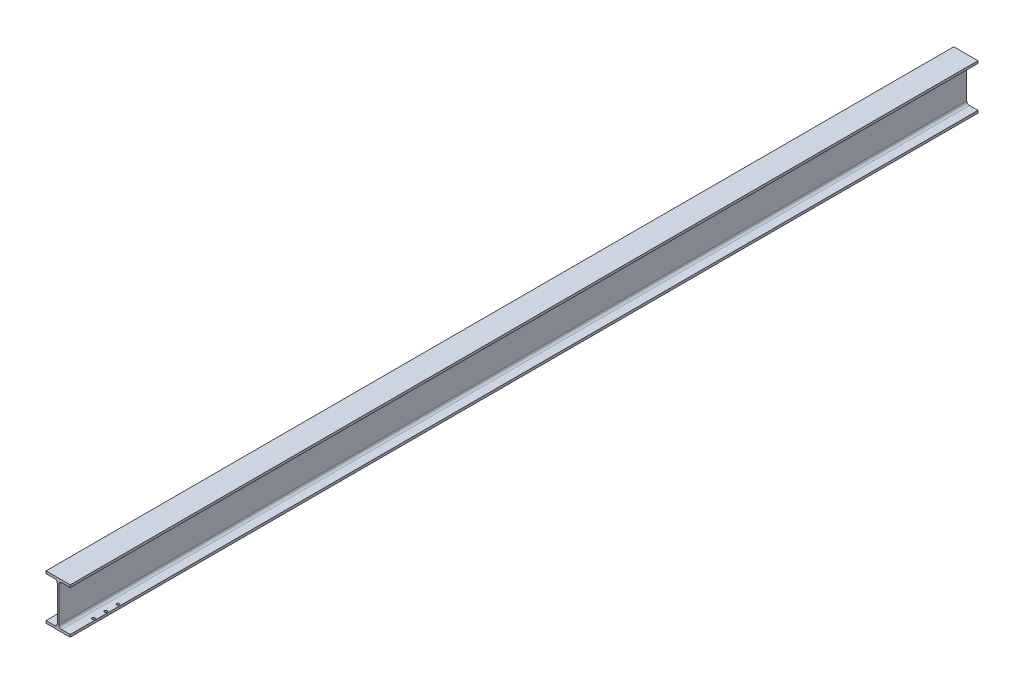
ISO-10303-21;
HEADER;
FILE_DESCRIPTION(('STEP AP214'),'2;1');
FILE_NAME('part.step','',(''),(''),'','','');
FILE_SCHEMA(('AUTOMOTIVE_DESIGN { 1 0 10303 214 1 1 1 1 }'));
ENDSEC;
DATA;
#1=APPLICATION_CONTEXT('core data for automotive mechanical design processes');
#2=APPLICATION_PROTOCOL_DEFINITION('international standard','automotive_design',2000,#1);
#3=PRODUCT_CONTEXT('',#1,'mechanical');
#4=PRODUCT('Part','Part','',(#3));
#5=PRODUCT_RELATED_PRODUCT_CATEGORY('part','',(#4));
#6=PRODUCT_DEFINITION_FORMATION('','',#4);
#7=PRODUCT_DEFINITION_CONTEXT('part definition',#1,'design');
#8=PRODUCT_DEFINITION('design','',#6,#7);
#9=PRODUCT_DEFINITION_SHAPE('','',#8);
#10=(LENGTH_UNIT() NAMED_UNIT(*) SI_UNIT(.MILLI.,.METRE.));
#11=(NAMED_UNIT(*) PLANE_ANGLE_UNIT() SI_UNIT($,.RADIAN.));
#12=(NAMED_UNIT(*) SI_UNIT($,.STERADIAN.) SOLID_ANGLE_UNIT());
#13=UNCERTAINTY_MEASURE_WITH_UNIT(LENGTH_MEASURE(1.E-05),#10,'distance_accuracy_value','');
#14=(GEOMETRIC_REPRESENTATION_CONTEXT(3) GLOBAL_UNCERTAINTY_ASSIGNED_CONTEXT((#13)) GLOBAL_UNIT_ASSIGNED_CONTEXT((#10,
#11,#12)) REPRESENTATION_CONTEXT('',''));
#15=CARTESIAN_POINT('',(0.,0.,0.));
#16=DIRECTION('',(0.,0.,1.));
#17=DIRECTION('',(1.,0.,0.));
#18=AXIS2_PLACEMENT_3D('',#15,#16,#17);
#19=CARTESIAN_POINT('',(0.,-60.,1200.));
#20=DIRECTION('',(0.,1.,0.));
#21=DIRECTION('',(-1.,0.,0.));
#22=AXIS2_PLACEMENT_3D('',#19,#20,#21);
#23=PLANE('',#22);
#24=CARTESIAN_POINT('',(25.9999999999999,-60.,1067.5));
#25=DIRECTION('',(0.,-1.,0.));
#26=DIRECTION('',(0.,0.,-1.));
#27=AXIS2_PLACEMENT_3D('',#24,#25,#26);
#28=CIRCLE('',#27,3.5);
#29=CARTESIAN_POINT('',(25.9999999999999,-60.,1064.));
#30=VERTEX_POINT('',#29);
#31=EDGE_CURVE('E563',#30,#30,#28,.T.);
#32=ORIENTED_EDGE('',*,*,#31,.F.);
#33=EDGE_LOOP('',(#32));
#34=FACE_BOUND('',#33,.T.);
#35=CARTESIAN_POINT('',(25.9999999999999,-60.,1100.));
#36=DIRECTION('',(0.,-1.,0.));
#37=DIRECTION('',(0.,0.,-1.));
#38=AXIS2_PLACEMENT_3D('',#35,#36,#37);
#39=CIRCLE('',#38,3.5);
#40=CARTESIAN_POINT('',(25.9999999999999,-60.,1096.5));
#41=VERTEX_POINT('',#40);
#42=EDGE_CURVE('E577',#41,#41,#39,.T.);
#43=ORIENTED_EDGE('',*,*,#42,.F.);
#44=EDGE_LOOP('',(#43));
#45=FACE_BOUND('',#44,.T.);
#46=DIRECTION('',(1.,0.,0.));
#47=VECTOR('',#46,1.);
#48=CARTESIAN_POINT('',(0.,-60.,-1200.));
#49=LINE('',#48,#47);
#50=CARTESIAN_POINT('',(-32.,-60.,-1200.));
#51=VERTEX_POINT('',#50);
#52=CARTESIAN_POINT('',(32.,-60.,-1200.));
#53=VERTEX_POINT('',#52);
#54=EDGE_CURVE('E165',#51,#53,#49,.T.);
#55=ORIENTED_EDGE('',*,*,#54,.T.);
#56=DIRECTION('',(0.,0.,-1.));
#57=VECTOR('',#56,1.);
#58=CARTESIAN_POINT('',(32.,-60.,1200.));
#59=LINE('',#58,#57);
#60=CARTESIAN_POINT('',(32.,-60.,1200.));
#61=VERTEX_POINT('',#60);
#62=EDGE_CURVE('E162',#61,#53,#59,.T.);
#63=ORIENTED_EDGE('',*,*,#62,.F.);
#64=DIRECTION('',(1.,0.,0.));
#65=VECTOR('',#64,1.);
#66=CARTESIAN_POINT('',(0.,-60.,1200.));
#67=LINE('',#66,#65);
#68=CARTESIAN_POINT('',(-32.,-60.,1200.));
#69=VERTEX_POINT('',#68);
#70=EDGE_CURVE('E147',#69,#61,#67,.T.);
#71=ORIENTED_EDGE('',*,*,#70,.F.);
#72=DIRECTION('',(0.,0.,-1.));
#73=VECTOR('',#72,1.);
#74=CARTESIAN_POINT('',(-32.,-60.,1200.));
#75=LINE('',#74,#73);
#76=EDGE_CURVE('E159',#69,#51,#75,.T.);
#77=ORIENTED_EDGE('',*,*,#76,.T.);
#78=EDGE_LOOP('',(#55,#63,#71,#77));
#79=FACE_BOUND('',#78,.T.);
#80=CARTESIAN_POINT('',(25.9999999999999,-60.,1132.5));
#81=DIRECTION('',(0.,-1.,0.));
#82=DIRECTION('',(0.,0.,-1.));
#83=AXIS2_PLACEMENT_3D('',#80,#81,#82);
#84=CIRCLE('',#83,3.5);
#85=CARTESIAN_POINT('',(25.9999999999999,-60.,1129.));
#86=VERTEX_POINT('',#85);
#87=EDGE_CURVE('E588',#86,#86,#84,.T.);
#88=ORIENTED_EDGE('',*,*,#87,.F.);
#89=EDGE_LOOP('',(#88));
#90=FACE_BOUND('',#89,.T.);
#91=CARTESIAN_POINT('',(-26.0000000000001,-60.,1132.5));
#92=DIRECTION('',(0.,-1.,0.));
#93=DIRECTION('',(0.,0.,-1.));
#94=AXIS2_PLACEMENT_3D('',#91,#92,#93);
#95=CIRCLE('',#94,3.5);
#96=CARTESIAN_POINT('',(-26.0000000000001,-60.,1129.));
#97=VERTEX_POINT('',#96);
#98=EDGE_CURVE('E583',#97,#97,#95,.T.);
#99=ORIENTED_EDGE('',*,*,#98,.F.);
#100=EDGE_LOOP('',(#99));
#101=FACE_BOUND('',#100,.T.);
#102=CARTESIAN_POINT('',(-26.0000000000001,-60.,1100.));
#103=DIRECTION('',(0.,-1.,0.));
#104=DIRECTION('',(0.,0.,-1.));
#105=AXIS2_PLACEMENT_3D('',#102,#103,#104);
#106=CIRCLE('',#105,3.5);
#107=CARTESIAN_POINT('',(-26.0000000000001,-60.,1096.5));
#108=VERTEX_POINT('',#107);
#109=EDGE_CURVE('E571',#108,#108,#106,.T.);
#110=ORIENTED_EDGE('',*,*,#109,.F.);
#111=EDGE_LOOP('',(#110));
#112=FACE_BOUND('',#111,.T.);
#113=CARTESIAN_POINT('',(-26.0000000000001,-60.,1067.5));
#114=DIRECTION('',(0.,-1.,0.));
#115=DIRECTION('',(0.,0.,-1.));
#116=AXIS2_PLACEMENT_3D('',#113,#114,#115);
#117=CIRCLE('',#116,3.5);
#118=CARTESIAN_POINT('',(-26.0000000000001,-60.,1064.));
#119=VERTEX_POINT('',#118);
#120=EDGE_CURVE('E560',#119,#119,#117,.T.);
#121=ORIENTED_EDGE('',*,*,#120,.F.);
#122=EDGE_LOOP('',(#121));
#123=FACE_BOUND('',#122,.T.);
#124=ADVANCED_FACE('F36',(#34,#45,#79,#90,#101,#112,#123),#23,.F.);
#125=CARTESIAN_POINT('',(-32.,60.,1200.));
#126=DIRECTION('',(0.,-1.,0.));
#127=DIRECTION('',(1.,0.,0.));
#128=AXIS2_PLACEMENT_3D('',#125,#126,#127);
#129=PLANE('',#128);
#130=DIRECTION('',(-1.,0.,0.));
#131=VECTOR('',#130,1.);
#132=CARTESIAN_POINT('',(-32.,60.,-1200.));
#133=LINE('',#132,#131);
#134=CARTESIAN_POINT('',(32.,60.,-1200.));
#135=VERTEX_POINT('',#134);
#136=CARTESIAN_POINT('',(-32.,60.,-1200.));
#137=VERTEX_POINT('',#136);
#138=EDGE_CURVE('E169',#135,#137,#133,.T.);
#139=ORIENTED_EDGE('',*,*,#138,.T.);
#140=DIRECTION('',(0.,0.,-1.));
#141=VECTOR('',#140,1.);
#142=CARTESIAN_POINT('',(-32.,60.,1200.));
#143=LINE('',#142,#141);
#144=CARTESIAN_POINT('',(-32.,60.,1200.));
#145=VERTEX_POINT('',#144);
#146=EDGE_CURVE('E244',#145,#137,#143,.T.);
#147=ORIENTED_EDGE('',*,*,#146,.F.);
#148=DIRECTION('',(-1.,0.,0.));
#149=VECTOR('',#148,1.);
#150=CARTESIAN_POINT('',(-32.,60.,1200.));
#151=LINE('',#150,#149);
#152=CARTESIAN_POINT('',(32.,60.,1200.));
#153=VERTEX_POINT('',#152);
#154=EDGE_CURVE('E210',#153,#145,#151,.T.);
#155=ORIENTED_EDGE('',*,*,#154,.F.);
#156=DIRECTION('',(0.,0.,-1.));
#157=VECTOR('',#156,1.);
#158=CARTESIAN_POINT('',(32.,60.,1200.));
#159=LINE('',#158,#157);
#160=EDGE_CURVE('E195',#153,#135,#159,.T.);
#161=ORIENTED_EDGE('',*,*,#160,.T.);
#162=EDGE_LOOP('',(#139,#147,#155,#161));
#163=FACE_BOUND('',#162,.T.);
#164=ADVANCED_FACE('F318',(#163),#129,.F.);
#165=CARTESIAN_POINT('',(-32.,53.7,1200.));
#166=DIRECTION('',(1.,0.,0.));
#167=DIRECTION('',(0.,0.,-1.));
#168=AXIS2_PLACEMENT_3D('',#165,#166,#167);
#169=PLANE('',#168);
#170=DIRECTION('',(0.,-1.,0.));
#171=VECTOR('',#170,1.);
#172=CARTESIAN_POINT('',(-32.,53.7,-1200.));
#173=LINE('',#172,#171);
#174=CARTESIAN_POINT('',(-32.,53.7,-1200.));
#175=VERTEX_POINT('',#174);
#176=EDGE_CURVE('E224',#137,#175,#173,.T.);
#177=ORIENTED_EDGE('',*,*,#176,.T.);
#178=DIRECTION('',(0.,0.,-1.));
#179=VECTOR('',#178,1.);
#180=CARTESIAN_POINT('',(-32.,53.7,1200.));
#181=LINE('',#180,#179);
#182=CARTESIAN_POINT('',(-32.,53.7,1200.));
#183=VERTEX_POINT('',#182);
#184=EDGE_CURVE('E241',#183,#175,#181,.T.);
#185=ORIENTED_EDGE('',*,*,#184,.F.);
#186=DIRECTION('',(0.,-1.,0.));
#187=VECTOR('',#186,1.);
#188=CARTESIAN_POINT('',(-32.,53.7,1200.));
#189=LINE('',#188,#187);
#190=EDGE_CURVE('E212',#145,#183,#189,.T.);
#191=ORIENTED_EDGE('',*,*,#190,.F.);
#192=ORIENTED_EDGE('',*,*,#146,.T.);
#193=EDGE_LOOP('',(#177,#185,#191,#192));
#194=FACE_BOUND('',#193,.T.);
#195=ADVANCED_FACE('F324',(#194),#169,.F.);
#196=CARTESIAN_POINT('',(-2.19999999999999,53.7,1200.));
#197=DIRECTION('',(0.,1.,0.));
#198=DIRECTION('',(0.,0.,1.));
#199=AXIS2_PLACEMENT_3D('',#196,#197,#198);
#200=PLANE('',#199);
#201=DIRECTION('',(1.,0.,0.));
#202=VECTOR('',#201,1.);
#203=CARTESIAN_POINT('',(-2.19999999999999,53.7,-1200.));
#204=LINE('',#203,#202);
#205=CARTESIAN_POINT('',(-9.19999999999999,53.7,-1200.));
#206=VERTEX_POINT('',#205);
#207=EDGE_CURVE('E226',#175,#206,#204,.T.);
#208=ORIENTED_EDGE('',*,*,#207,.T.);
#209=DIRECTION('',(0.,0.,-1.));
#210=VECTOR('',#209,1.);
#211=CARTESIAN_POINT('',(-9.19999999999999,53.7,1200.));
#212=LINE('',#211,#210);
#213=CARTESIAN_POINT('',(-9.19999999999999,53.7,1200.));
#214=VERTEX_POINT('',#213);
#215=EDGE_CURVE('E262',#206,#214,#212,.F.);
#216=ORIENTED_EDGE('',*,*,#215,.T.);
#217=DIRECTION('',(1.,0.,0.));
#218=VECTOR('',#217,1.);
#219=CARTESIAN_POINT('',(-2.19999999999999,53.7,1200.));
#220=LINE('',#219,#218);
#221=EDGE_CURVE('E214',#183,#214,#220,.T.);
#222=ORIENTED_EDGE('',*,*,#221,.F.);
#223=ORIENTED_EDGE('',*,*,#184,.T.);
#224=EDGE_LOOP('',(#208,#216,#222,#223));
#225=FACE_BOUND('',#224,.T.);
#226=ADVANCED_FACE('F327',(#225),#200,.F.);
#227=CARTESIAN_POINT('',(-2.19999999999999,-53.7,1200.));
#228=DIRECTION('',(1.,0.,0.));
#229=DIRECTION('',(0.,1.,0.));
#230=AXIS2_PLACEMENT_3D('',#227,#228,#229);
#231=PLANE('',#230);
#232=DIRECTION('',(0.,-1.,0.));
#233=VECTOR('',#232,1.);
#234=CARTESIAN_POINT('',(-2.19999999999999,-53.7,1200.));
#235=LINE('',#234,#233);
#236=CARTESIAN_POINT('',(-2.19999999999999,46.7,1200.));
#237=VERTEX_POINT('',#236);
#238=CARTESIAN_POINT('',(-2.19999999999999,-46.7,1200.));
#239=VERTEX_POINT('',#238);
#240=EDGE_CURVE('E217',#237,#239,#235,.T.);
#241=ORIENTED_EDGE('',*,*,#240,.F.);
#242=DIRECTION('',(0.,0.,-1.));
#243=VECTOR('',#242,1.);
#244=CARTESIAN_POINT('',(-2.19999999999999,46.7,-1200.));
#245=LINE('',#244,#243);
#246=CARTESIAN_POINT('',(-2.19999999999999,46.7,-1200.));
#247=VERTEX_POINT('',#246);
#248=EDGE_CURVE('E259',#237,#247,#245,.T.);
#249=ORIENTED_EDGE('',*,*,#248,.T.);
#250=DIRECTION('',(0.,-1.,0.));
#251=VECTOR('',#250,1.);
#252=CARTESIAN_POINT('',(-2.19999999999999,-53.7,-1200.));
#253=LINE('',#252,#251);
#254=CARTESIAN_POINT('',(-2.19999999999999,-46.7,-1200.));
#255=VERTEX_POINT('',#254);
#256=EDGE_CURVE('E229',#247,#255,#253,.T.);
#257=ORIENTED_EDGE('',*,*,#256,.T.);
#258=DIRECTION('',(0.,0.,-1.));
#259=VECTOR('',#258,1.);
#260=CARTESIAN_POINT('',(-2.19999999999999,-46.7,1200.));
#261=LINE('',#260,#259);
#262=EDGE_CURVE('E257',#255,#239,#261,.F.);
#263=ORIENTED_EDGE('',*,*,#262,.T.);
#264=EDGE_LOOP('',(#241,#249,#257,#263));
#265=FACE_BOUND('',#264,.T.);
#266=ADVANCED_FACE('F284',(#265),#231,.F.);
#267=CARTESIAN_POINT('',(-32.,-53.7,1200.));
#268=DIRECTION('',(0.,-1.,0.));
#269=DIRECTION('',(0.,0.,-1.));
#270=AXIS2_PLACEMENT_3D('',#267,#268,#269);
#271=PLANE('',#270);
#272=CARTESIAN_POINT('',(-26.0000000000001,-53.7,1067.5));
#273=DIRECTION('',(0.,-1.,0.));
#274=DIRECTION('',(0.,0.,-1.));
#275=AXIS2_PLACEMENT_3D('',#272,#273,#274);
#276=CIRCLE('',#275,3.5);
#277=CARTESIAN_POINT('',(-26.0000000000001,-53.7,1064.));
#278=VERTEX_POINT('',#277);
#279=EDGE_CURVE('E557',#278,#278,#276,.T.);
#280=ORIENTED_EDGE('',*,*,#279,.T.);
#281=EDGE_LOOP('',(#280));
#282=FACE_BOUND('',#281,.T.);
#283=CARTESIAN_POINT('',(-26.0000000000001,-53.7,1100.));
#284=DIRECTION('',(0.,-1.,0.));
#285=DIRECTION('',(0.,0.,-1.));
#286=AXIS2_PLACEMENT_3D('',#283,#284,#285);
#287=CIRCLE('',#286,3.5);
#288=CARTESIAN_POINT('',(-26.0000000000001,-53.7,1096.5));
#289=VERTEX_POINT('',#288);
#290=EDGE_CURVE('E574',#289,#289,#287,.T.);
#291=ORIENTED_EDGE('',*,*,#290,.T.);
#292=EDGE_LOOP('',(#291));
#293=FACE_BOUND('',#292,.T.);
#294=CARTESIAN_POINT('',(-26.0000000000001,-53.7,1132.5));
#295=DIRECTION('',(0.,-1.,0.));
#296=DIRECTION('',(0.,0.,-1.));
#297=AXIS2_PLACEMENT_3D('',#294,#295,#296);
#298=CIRCLE('',#297,3.5);
#299=CARTESIAN_POINT('',(-26.0000000000001,-53.7,1129.));
#300=VERTEX_POINT('',#299);
#301=EDGE_CURVE('E586',#300,#300,#298,.T.);
#302=ORIENTED_EDGE('',*,*,#301,.T.);
#303=EDGE_LOOP('',(#302));
#304=FACE_BOUND('',#303,.T.);
#305=DIRECTION('',(-1.,0.,0.));
#306=VECTOR('',#305,1.);
#307=CARTESIAN_POINT('',(-32.,-53.7,1200.));
#308=LINE('',#307,#306);
#309=CARTESIAN_POINT('',(-9.19999999999999,-53.7,1200.));
#310=VERTEX_POINT('',#309);
#311=CARTESIAN_POINT('',(-32.,-53.7,1200.));
#312=VERTEX_POINT('',#311);
#313=EDGE_CURVE('E219',#310,#312,#308,.T.);
#314=ORIENTED_EDGE('',*,*,#313,.F.);
#315=DIRECTION('',(0.,0.,-1.));
#316=VECTOR('',#315,1.);
#317=CARTESIAN_POINT('',(-9.19999999999999,-53.7,-1200.));
#318=LINE('',#317,#316);
#319=CARTESIAN_POINT('',(-9.19999999999999,-53.7,-1200.));
#320=VERTEX_POINT('',#319);
#321=EDGE_CURVE('E264',#310,#320,#318,.T.);
#322=ORIENTED_EDGE('',*,*,#321,.T.);
#323=DIRECTION('',(-1.,0.,0.));
#324=VECTOR('',#323,1.);
#325=CARTESIAN_POINT('',(-32.,-53.7,-1200.));
#326=LINE('',#325,#324);
#327=CARTESIAN_POINT('',(-32.,-53.7,-1200.));
#328=VERTEX_POINT('',#327);
#329=EDGE_CURVE('E232',#320,#328,#326,.T.);
#330=ORIENTED_EDGE('',*,*,#329,.T.);
#331=DIRECTION('',(0.,0.,-1.));
#332=VECTOR('',#331,1.);
#333=CARTESIAN_POINT('',(-32.,-53.7,1200.));
#334=LINE('',#333,#332);
#335=EDGE_CURVE('E238',#312,#328,#334,.T.);
#336=ORIENTED_EDGE('',*,*,#335,.F.);
#337=EDGE_LOOP('',(#314,#322,#330,#336));
#338=FACE_BOUND('',#337,.T.);
#339=ADVANCED_FACE('F287',(#282,#293,#304,#338),#271,.F.);
#340=CARTESIAN_POINT('',(-32.,-60.,1200.));
#341=DIRECTION('',(1.,0.,0.));
#342=DIRECTION('',(0.,0.,-1.));
#343=AXIS2_PLACEMENT_3D('',#340,#341,#342);
#344=PLANE('',#343);
#345=DIRECTION('',(0.,-1.,0.));
#346=VECTOR('',#345,1.);
#347=CARTESIAN_POINT('',(-32.,-60.,-1200.));
#348=LINE('',#347,#346);
#349=EDGE_CURVE('E234',#328,#51,#348,.T.);
#350=ORIENTED_EDGE('',*,*,#349,.T.);
#351=ORIENTED_EDGE('',*,*,#76,.F.);
#352=DIRECTION('',(0.,-1.,0.));
#353=VECTOR('',#352,1.);
#354=CARTESIAN_POINT('',(-32.,-60.,1200.));
#355=LINE('',#354,#353);
#356=EDGE_CURVE('E155',#312,#69,#355,.T.);
#357=ORIENTED_EDGE('',*,*,#356,.F.);
#358=ORIENTED_EDGE('',*,*,#335,.T.);
#359=EDGE_LOOP('',(#350,#351,#357,#358));
#360=FACE_BOUND('',#359,.T.);
#361=ADVANCED_FACE('F290',(#360),#344,.F.);
#362=CARTESIAN_POINT('',(0.,0.,1200.));
#363=DIRECTION('',(0.,0.,-1.));
#364=DIRECTION('',(-1.,0.,0.));
#365=AXIS2_PLACEMENT_3D('',#362,#363,#364);
#366=PLANE('',#365);
#367=ORIENTED_EDGE('',*,*,#154,.T.);
#368=ORIENTED_EDGE('',*,*,#190,.T.);
#369=ORIENTED_EDGE('',*,*,#221,.T.);
#370=CARTESIAN_POINT('',(-9.19999999999999,46.7,1200.));
#371=DIRECTION('',(0.,0.,-1.));
#372=DIRECTION('',(-1.,0.,0.));
#373=AXIS2_PLACEMENT_3D('',#370,#371,#372);
#374=CIRCLE('',#373,7.);
#375=EDGE_CURVE('E276',#214,#237,#374,.T.);
#376=ORIENTED_EDGE('',*,*,#375,.T.);
#377=ORIENTED_EDGE('',*,*,#240,.T.);
#378=CARTESIAN_POINT('',(-9.19999999999999,-46.7,1200.));
#379=DIRECTION('',(0.,0.,-1.));
#380=DIRECTION('',(-1.,0.,0.));
#381=AXIS2_PLACEMENT_3D('',#378,#379,#380);
#382=CIRCLE('',#381,7.);
#383=EDGE_CURVE('E11',#239,#310,#382,.T.);
#384=ORIENTED_EDGE('',*,*,#383,.T.);
#385=ORIENTED_EDGE('',*,*,#313,.T.);
#386=ORIENTED_EDGE('',*,*,#356,.T.);
#387=ORIENTED_EDGE('',*,*,#70,.T.);
#388=DIRECTION('',(0.,-1.,0.));
#389=VECTOR('',#388,1.);
#390=CARTESIAN_POINT('',(32.,-60.,1200.));
#391=LINE('',#390,#389);
#392=CARTESIAN_POINT('',(32.,-53.7,1200.));
#393=VERTEX_POINT('',#392);
#394=EDGE_CURVE('E153',#393,#61,#391,.T.);
#395=ORIENTED_EDGE('',*,*,#394,.F.);
#396=DIRECTION('',(1.,0.,0.));
#397=VECTOR('',#396,1.);
#398=CARTESIAN_POINT('',(32.,-53.7,1200.));
#399=LINE('',#398,#397);
#400=CARTESIAN_POINT('',(9.20000000000001,-53.7,1200.));
#401=VERTEX_POINT('',#400);
#402=EDGE_CURVE('E175',#401,#393,#399,.T.);
#403=ORIENTED_EDGE('',*,*,#402,.F.);
#404=CARTESIAN_POINT('',(9.2,-46.7,1200.));
#405=DIRECTION('',(0.,0.,-1.));
#406=DIRECTION('',(-1.,0.,0.));
#407=AXIS2_PLACEMENT_3D('',#404,#405,#406);
#408=CIRCLE('',#407,7.);
#409=CARTESIAN_POINT('',(2.2,-46.7,1200.));
#410=VERTEX_POINT('',#409);
#411=EDGE_CURVE('E268',#401,#410,#408,.T.);
#412=ORIENTED_EDGE('',*,*,#411,.T.);
#413=DIRECTION('',(0.,-1.,0.));
#414=VECTOR('',#413,1.);
#415=CARTESIAN_POINT('',(2.2,-53.7,1200.));
#416=LINE('',#415,#414);
#417=CARTESIAN_POINT('',(2.19999999999997,46.7,1200.));
#418=VERTEX_POINT('',#417);
#419=EDGE_CURVE('E178',#418,#410,#416,.T.);
#420=ORIENTED_EDGE('',*,*,#419,.F.);
#421=CARTESIAN_POINT('',(9.19999999999997,46.7,1200.));
#422=DIRECTION('',(0.,0.,-1.));
#423=DIRECTION('',(-1.,0.,0.));
#424=AXIS2_PLACEMENT_3D('',#421,#422,#423);
#425=CIRCLE('',#424,7.);
#426=CARTESIAN_POINT('',(9.19999999999997,53.7,1200.));
#427=VERTEX_POINT('',#426);
#428=EDGE_CURVE('E272',#418,#427,#425,.T.);
#429=ORIENTED_EDGE('',*,*,#428,.T.);
#430=DIRECTION('',(-1.,0.,0.));
#431=VECTOR('',#430,1.);
#432=CARTESIAN_POINT('',(2.19999999999997,53.7,1200.));
#433=LINE('',#432,#431);
#434=CARTESIAN_POINT('',(32.,53.7,1200.));
#435=VERTEX_POINT('',#434);
#436=EDGE_CURVE('E189',#435,#427,#433,.T.);
#437=ORIENTED_EDGE('',*,*,#436,.F.);
#438=DIRECTION('',(0.,-1.,0.));
#439=VECTOR('',#438,1.);
#440=CARTESIAN_POINT('',(32.,53.7,1200.));
#441=LINE('',#440,#439);
#442=EDGE_CURVE('E192',#153,#435,#441,.T.);
#443=ORIENTED_EDGE('',*,*,#442,.F.);
#444=EDGE_LOOP('',(#367,#368,#369,#376,#377,#384,#385,#386,#387,#395,#403,#412,#420,#429,#437,#443));
#445=FACE_BOUND('',#444,.T.);
#446=ADVANCED_FACE('F150',(#445),#366,.F.);
#447=CARTESIAN_POINT('',(0.,0.,-1200.));
#448=DIRECTION('',(0.,0.,-1.));
#449=DIRECTION('',(-1.,0.,0.));
#450=AXIS2_PLACEMENT_3D('',#447,#448,#449);
#451=PLANE('',#450);
#452=ORIENTED_EDGE('',*,*,#138,.F.);
#453=DIRECTION('',(0.,-1.,0.));
#454=VECTOR('',#453,1.);
#455=CARTESIAN_POINT('',(32.,53.7,-1200.));
#456=LINE('',#455,#454);
#457=CARTESIAN_POINT('',(32.,53.7,-1200.));
#458=VERTEX_POINT('',#457);
#459=EDGE_CURVE('E176',#135,#458,#456,.T.);
#460=ORIENTED_EDGE('',*,*,#459,.T.);
#461=DIRECTION('',(-1.,0.,0.));
#462=VECTOR('',#461,1.);
#463=CARTESIAN_POINT('',(2.19999999999997,53.7,-1200.));
#464=LINE('',#463,#462);
#465=CARTESIAN_POINT('',(9.19999999999997,53.7,-1200.));
#466=VERTEX_POINT('',#465);
#467=EDGE_CURVE('E181',#458,#466,#464,.T.);
#468=ORIENTED_EDGE('',*,*,#467,.T.);
#469=CARTESIAN_POINT('',(9.19999999999997,46.7,-1200.));
#470=DIRECTION('',(0.,0.,-1.));
#471=DIRECTION('',(-1.,0.,0.));
#472=AXIS2_PLACEMENT_3D('',#469,#470,#471);
#473=CIRCLE('',#472,7.);
#474=CARTESIAN_POINT('',(2.19999999999997,46.7,-1200.));
#475=VERTEX_POINT('',#474);
#476=EDGE_CURVE('E270',#466,#475,#473,.F.);
#477=ORIENTED_EDGE('',*,*,#476,.T.);
#478=DIRECTION('',(0.,-1.,0.));
#479=VECTOR('',#478,1.);
#480=CARTESIAN_POINT('',(2.2,-53.7,-1200.));
#481=LINE('',#480,#479);
#482=CARTESIAN_POINT('',(2.2,-46.7,-1200.));
#483=VERTEX_POINT('',#482);
#484=EDGE_CURVE('E200',#475,#483,#481,.T.);
#485=ORIENTED_EDGE('',*,*,#484,.T.);
#486=CARTESIAN_POINT('',(9.2,-46.7,-1200.));
#487=DIRECTION('',(0.,0.,-1.));
#488=DIRECTION('',(-1.,0.,0.));
#489=AXIS2_PLACEMENT_3D('',#486,#487,#488);
#490=CIRCLE('',#489,7.);
#491=CARTESIAN_POINT('',(9.20000000000001,-53.7,-1200.));
#492=VERTEX_POINT('',#491);
#493=EDGE_CURVE('E266',#483,#492,#490,.F.);
#494=ORIENTED_EDGE('',*,*,#493,.T.);
#495=DIRECTION('',(1.,0.,0.));
#496=VECTOR('',#495,1.);
#497=CARTESIAN_POINT('',(32.,-53.7,-1200.));
#498=LINE('',#497,#496);
#499=CARTESIAN_POINT('',(32.,-53.7,-1200.));
#500=VERTEX_POINT('',#499);
#501=EDGE_CURVE('E198',#492,#500,#498,.T.);
#502=ORIENTED_EDGE('',*,*,#501,.T.);
#503=DIRECTION('',(0.,-1.,0.));
#504=VECTOR('',#503,1.);
#505=CARTESIAN_POINT('',(32.,-60.,-1200.));
#506=LINE('',#505,#504);
#507=EDGE_CURVE('E196',#500,#53,#506,.T.);
#508=ORIENTED_EDGE('',*,*,#507,.T.);
#509=ORIENTED_EDGE('',*,*,#54,.F.);
#510=ORIENTED_EDGE('',*,*,#349,.F.);
#511=ORIENTED_EDGE('',*,*,#329,.F.);
#512=CARTESIAN_POINT('',(-9.19999999999999,-46.7,-1200.));
#513=DIRECTION('',(0.,0.,-1.));
#514=DIRECTION('',(-1.,0.,0.));
#515=AXIS2_PLACEMENT_3D('',#512,#513,#514);
#516=CIRCLE('',#515,7.);
#517=EDGE_CURVE('E44',#320,#255,#516,.F.);
#518=ORIENTED_EDGE('',*,*,#517,.T.);
#519=ORIENTED_EDGE('',*,*,#256,.F.);
#520=CARTESIAN_POINT('',(-9.19999999999999,46.7,-1200.));
#521=DIRECTION('',(0.,0.,-1.));
#522=DIRECTION('',(-1.,0.,0.));
#523=AXIS2_PLACEMENT_3D('',#520,#521,#522);
#524=CIRCLE('',#523,7.);
#525=EDGE_CURVE('E274',#247,#206,#524,.F.);
#526=ORIENTED_EDGE('',*,*,#525,.T.);
#527=ORIENTED_EDGE('',*,*,#207,.F.);
#528=ORIENTED_EDGE('',*,*,#176,.F.);
#529=EDGE_LOOP('',(#452,#460,#468,#477,#485,#494,#502,#508,#509,#510,#511,#518,#519,#526,#527,#528));
#530=FACE_BOUND('',#529,.T.);
#531=ADVANCED_FACE('F280',(#530),#451,.T.);
#532=CARTESIAN_POINT('',(32.,-60.,1200.));
#533=DIRECTION('',(1.,0.,0.));
#534=DIRECTION('',(0.,1.,0.));
#535=AXIS2_PLACEMENT_3D('',#532,#533,#534);
#536=PLANE('',#535);
#537=ORIENTED_EDGE('',*,*,#507,.F.);
#538=DIRECTION('',(0.,0.,-1.));
#539=VECTOR('',#538,1.);
#540=CARTESIAN_POINT('',(32.,-53.7,1200.));
#541=LINE('',#540,#539);
#542=EDGE_CURVE('E170',#393,#500,#541,.T.);
#543=ORIENTED_EDGE('',*,*,#542,.F.);
#544=ORIENTED_EDGE('',*,*,#394,.T.);
#545=ORIENTED_EDGE('',*,*,#62,.T.);
#546=EDGE_LOOP('',(#537,#543,#544,#545));
#547=FACE_BOUND('',#546,.T.);
#548=ADVANCED_FACE('F173',(#547),#536,.T.);
#549=CARTESIAN_POINT('',(32.,-53.7,1200.));
#550=DIRECTION('',(0.,1.,0.));
#551=DIRECTION('',(-1.,0.,0.));
#552=AXIS2_PLACEMENT_3D('',#549,#550,#551);
#553=PLANE('',#552);
#554=CARTESIAN_POINT('',(25.9999999999999,-53.7,1067.5));
#555=DIRECTION('',(0.,1.,0.));
#556=DIRECTION('',(-1.,0.,0.));
#557=AXIS2_PLACEMENT_3D('',#554,#555,#556);
#558=CIRCLE('',#557,3.5);
#559=CARTESIAN_POINT('',(22.4999999999999,-53.7,1067.5));
#560=VERTEX_POINT('',#559);
#561=EDGE_CURVE('E568',#560,#560,#558,.T.);
#562=ORIENTED_EDGE('',*,*,#561,.F.);
#563=EDGE_LOOP('',(#562));
#564=FACE_BOUND('',#563,.T.);
#565=CARTESIAN_POINT('',(25.9999999999999,-53.7,1100.));
#566=DIRECTION('',(0.,1.,0.));
#567=DIRECTION('',(-1.,0.,0.));
#568=AXIS2_PLACEMENT_3D('',#565,#566,#567);
#569=CIRCLE('',#568,3.5);
#570=CARTESIAN_POINT('',(22.4999999999999,-53.7,1100.));
#571=VERTEX_POINT('',#570);
#572=EDGE_CURVE('E580',#571,#571,#569,.T.);
#573=ORIENTED_EDGE('',*,*,#572,.F.);
#574=EDGE_LOOP('',(#573));
#575=FACE_BOUND('',#574,.T.);
#576=CARTESIAN_POINT('',(25.9999999999999,-53.7,1132.5));
#577=DIRECTION('',(0.,1.,0.));
#578=DIRECTION('',(-1.,0.,0.));
#579=AXIS2_PLACEMENT_3D('',#576,#577,#578);
#580=CIRCLE('',#579,3.5);
#581=CARTESIAN_POINT('',(22.4999999999999,-53.7,1132.5));
#582=VERTEX_POINT('',#581);
#583=EDGE_CURVE('E184',#582,#582,#580,.T.);
#584=ORIENTED_EDGE('',*,*,#583,.F.);
#585=EDGE_LOOP('',(#584));
#586=FACE_BOUND('',#585,.T.);
#587=ORIENTED_EDGE('',*,*,#501,.F.);
#588=DIRECTION('',(0.,0.,-1.));
#589=VECTOR('',#588,1.);
#590=CARTESIAN_POINT('',(9.2,-53.7,1200.));
#591=LINE('',#590,#589);
#592=EDGE_CURVE('E252',#492,#401,#591,.F.);
#593=ORIENTED_EDGE('',*,*,#592,.T.);
#594=ORIENTED_EDGE('',*,*,#402,.T.);
#595=ORIENTED_EDGE('',*,*,#542,.T.);
#596=EDGE_LOOP('',(#587,#593,#594,#595));
#597=FACE_BOUND('',#596,.T.);
#598=ADVANCED_FACE('F294',(#564,#575,#586,#597),#553,.T.);
#599=CARTESIAN_POINT('',(2.2,-53.7,1200.));
#600=DIRECTION('',(1.,0.,0.));
#601=DIRECTION('',(0.,1.,0.));
#602=AXIS2_PLACEMENT_3D('',#599,#600,#601);
#603=PLANE('',#602);
#604=ORIENTED_EDGE('',*,*,#419,.T.);
#605=DIRECTION('',(0.,0.,-1.));
#606=VECTOR('',#605,1.);
#607=CARTESIAN_POINT('',(2.2,-46.7,-1200.));
#608=LINE('',#607,#606);
#609=EDGE_CURVE('E249',#410,#483,#608,.T.);
#610=ORIENTED_EDGE('',*,*,#609,.T.);
#611=ORIENTED_EDGE('',*,*,#484,.F.);
#612=DIRECTION('',(0.,0.,-1.));
#613=VECTOR('',#612,1.);
#614=CARTESIAN_POINT('',(2.19999999999997,46.7,1200.));
#615=LINE('',#614,#613);
#616=EDGE_CURVE('E247',#475,#418,#615,.F.);
#617=ORIENTED_EDGE('',*,*,#616,.T.);
#618=EDGE_LOOP('',(#604,#610,#611,#617));
#619=FACE_BOUND('',#618,.T.);
#620=ADVANCED_FACE('F302',(#619),#603,.T.);
#621=CARTESIAN_POINT('',(2.19999999999997,53.7,1200.));
#622=DIRECTION('',(0.,-1.,0.));
#623=DIRECTION('',(1.,0.,0.));
#624=AXIS2_PLACEMENT_3D('',#621,#622,#623);
#625=PLANE('',#624);
#626=ORIENTED_EDGE('',*,*,#436,.T.);
#627=DIRECTION('',(0.,0.,-1.));
#628=VECTOR('',#627,1.);
#629=CARTESIAN_POINT('',(9.19999999999997,53.7,-1200.));
#630=LINE('',#629,#628);
#631=EDGE_CURVE('E254',#427,#466,#630,.T.);
#632=ORIENTED_EDGE('',*,*,#631,.T.);
#633=ORIENTED_EDGE('',*,*,#467,.F.);
#634=DIRECTION('',(0.,0.,-1.));
#635=VECTOR('',#634,1.);
#636=CARTESIAN_POINT('',(32.,53.7,1200.));
#637=LINE('',#636,#635);
#638=EDGE_CURVE('E207',#435,#458,#637,.T.);
#639=ORIENTED_EDGE('',*,*,#638,.F.);
#640=EDGE_LOOP('',(#626,#632,#633,#639));
#641=FACE_BOUND('',#640,.T.);
#642=ADVANCED_FACE('F310',(#641),#625,.T.);
#643=CARTESIAN_POINT('',(32.,53.7,1200.));
#644=DIRECTION('',(1.,0.,0.));
#645=DIRECTION('',(0.,1.,0.));
#646=AXIS2_PLACEMENT_3D('',#643,#644,#645);
#647=PLANE('',#646);
#648=ORIENTED_EDGE('',*,*,#459,.F.);
#649=ORIENTED_EDGE('',*,*,#160,.F.);
#650=ORIENTED_EDGE('',*,*,#442,.T.);
#651=ORIENTED_EDGE('',*,*,#638,.T.);
#652=EDGE_LOOP('',(#648,#649,#650,#651));
#653=FACE_BOUND('',#652,.T.);
#654=ADVANCED_FACE('F316',(#653),#647,.T.);
#655=CARTESIAN_POINT('',(9.2,-46.7,1200.));
#656=DIRECTION('',(0.,0.,1.));
#657=DIRECTION('',(1.,0.,0.));
#658=AXIS2_PLACEMENT_3D('',#655,#656,#657);
#659=CYLINDRICAL_SURFACE('',#658,7.);
#660=ORIENTED_EDGE('',*,*,#411,.F.);
#661=ORIENTED_EDGE('',*,*,#592,.F.);
#662=ORIENTED_EDGE('',*,*,#493,.F.);
#663=ORIENTED_EDGE('',*,*,#609,.F.);
#664=EDGE_LOOP('',(#660,#661,#662,#663));
#665=FACE_BOUND('',#664,.T.);
#666=ADVANCED_FACE('F299',(#665),#659,.F.);
#667=CARTESIAN_POINT('',(9.19999999999997,46.7,1200.));
#668=DIRECTION('',(0.,0.,1.));
#669=DIRECTION('',(1.,0.,0.));
#670=AXIS2_PLACEMENT_3D('',#667,#668,#669);
#671=CYLINDRICAL_SURFACE('',#670,7.);
#672=ORIENTED_EDGE('',*,*,#428,.F.);
#673=ORIENTED_EDGE('',*,*,#616,.F.);
#674=ORIENTED_EDGE('',*,*,#476,.F.);
#675=ORIENTED_EDGE('',*,*,#631,.F.);
#676=EDGE_LOOP('',(#672,#673,#674,#675));
#677=FACE_BOUND('',#676,.T.);
#678=ADVANCED_FACE('F308',(#677),#671,.F.);
#679=CARTESIAN_POINT('',(-9.19999999999999,46.7,1200.));
#680=DIRECTION('',(0.,0.,1.));
#681=DIRECTION('',(1.,0.,0.));
#682=AXIS2_PLACEMENT_3D('',#679,#680,#681);
#683=CYLINDRICAL_SURFACE('',#682,7.);
#684=ORIENTED_EDGE('',*,*,#375,.F.);
#685=ORIENTED_EDGE('',*,*,#215,.F.);
#686=ORIENTED_EDGE('',*,*,#525,.F.);
#687=ORIENTED_EDGE('',*,*,#248,.F.);
#688=EDGE_LOOP('',(#684,#685,#686,#687));
#689=FACE_BOUND('',#688,.T.);
#690=ADVANCED_FACE('F330',(#689),#683,.F.);
#691=CARTESIAN_POINT('',(-9.19999999999999,-46.7,1200.));
#692=DIRECTION('',(0.,0.,1.));
#693=DIRECTION('',(1.,0.,0.));
#694=AXIS2_PLACEMENT_3D('',#691,#692,#693);
#695=CYLINDRICAL_SURFACE('',#694,7.);
#696=ORIENTED_EDGE('',*,*,#383,.F.);
#697=ORIENTED_EDGE('',*,*,#262,.F.);
#698=ORIENTED_EDGE('',*,*,#517,.F.);
#699=ORIENTED_EDGE('',*,*,#321,.F.);
#700=EDGE_LOOP('',(#696,#697,#698,#699));
#701=FACE_BOUND('',#700,.T.);
#702=ADVANCED_FACE('F38',(#701),#695,.F.);
#703=CARTESIAN_POINT('',(25.9999999999999,-60.,1132.5));
#704=DIRECTION('',(0.,-1.,0.));
#705=DIRECTION('',(0.,0.,-1.));
#706=AXIS2_PLACEMENT_3D('',#703,#704,#705);
#707=CYLINDRICAL_SURFACE('',#706,3.5);
#708=ORIENTED_EDGE('',*,*,#87,.T.);
#709=EDGE_LOOP('',(#708));
#710=FACE_BOUND('',#709,.T.);
#711=ORIENTED_EDGE('',*,*,#583,.T.);
#712=EDGE_LOOP('',(#711));
#713=FACE_BOUND('',#712,.T.);
#714=ADVANCED_FACE('F336',(#710,#713),#707,.F.);
#715=CARTESIAN_POINT('',(-26.0000000000001,-60.,1132.5));
#716=DIRECTION('',(0.,-1.,0.));
#717=DIRECTION('',(0.,0.,-1.));
#718=AXIS2_PLACEMENT_3D('',#715,#716,#717);
#719=CYLINDRICAL_SURFACE('',#718,3.5);
#720=ORIENTED_EDGE('',*,*,#301,.F.);
#721=EDGE_LOOP('',(#720));
#722=FACE_BOUND('',#721,.T.);
#723=ORIENTED_EDGE('',*,*,#98,.T.);
#724=EDGE_LOOP('',(#723));
#725=FACE_BOUND('',#724,.T.);
#726=ADVANCED_FACE('F433',(#722,#725),#719,.F.);
#727=CARTESIAN_POINT('',(25.9999999999999,-60.,1100.));
#728=DIRECTION('',(0.,-1.,0.));
#729=DIRECTION('',(0.,0.,-1.));
#730=AXIS2_PLACEMENT_3D('',#727,#728,#729);
#731=CYLINDRICAL_SURFACE('',#730,3.5);
#732=ORIENTED_EDGE('',*,*,#42,.T.);
#733=EDGE_LOOP('',(#732));
#734=FACE_BOUND('',#733,.T.);
#735=ORIENTED_EDGE('',*,*,#572,.T.);
#736=EDGE_LOOP('',(#735));
#737=FACE_BOUND('',#736,.T.);
#738=ADVANCED_FACE('F512',(#734,#737),#731,.F.);
#739=CARTESIAN_POINT('',(-26.0000000000001,-60.,1100.));
#740=DIRECTION('',(0.,-1.,0.));
#741=DIRECTION('',(0.,0.,-1.));
#742=AXIS2_PLACEMENT_3D('',#739,#740,#741);
#743=CYLINDRICAL_SURFACE('',#742,3.5);
#744=ORIENTED_EDGE('',*,*,#290,.F.);
#745=EDGE_LOOP('',(#744));
#746=FACE_BOUND('',#745,.T.);
#747=ORIENTED_EDGE('',*,*,#109,.T.);
#748=EDGE_LOOP('',(#747));
#749=FACE_BOUND('',#748,.T.);
#750=ADVANCED_FACE('F520',(#746,#749),#743,.F.);
#751=CARTESIAN_POINT('',(25.9999999999999,-60.,1067.5));
#752=DIRECTION('',(0.,-1.,0.));
#753=DIRECTION('',(0.,0.,-1.));
#754=AXIS2_PLACEMENT_3D('',#751,#752,#753);
#755=CYLINDRICAL_SURFACE('',#754,3.5);
#756=ORIENTED_EDGE('',*,*,#31,.T.);
#757=EDGE_LOOP('',(#756));
#758=FACE_BOUND('',#757,.T.);
#759=ORIENTED_EDGE('',*,*,#561,.T.);
#760=EDGE_LOOP('',(#759));
#761=FACE_BOUND('',#760,.T.);
#762=ADVANCED_FACE('F529',(#758,#761),#755,.F.);
#763=CARTESIAN_POINT('',(-26.0000000000001,-60.,1067.5));
#764=DIRECTION('',(0.,-1.,0.));
#765=DIRECTION('',(0.,0.,-1.));
#766=AXIS2_PLACEMENT_3D('',#763,#764,#765);
#767=CYLINDRICAL_SURFACE('',#766,3.5);
#768=ORIENTED_EDGE('',*,*,#279,.F.);
#769=EDGE_LOOP('',(#768));
#770=FACE_BOUND('',#769,.T.);
#771=ORIENTED_EDGE('',*,*,#120,.T.);
#772=EDGE_LOOP('',(#771));
#773=FACE_BOUND('',#772,.T.);
#774=ADVANCED_FACE('F538',(#770,#773),#767,.F.);
#775=CLOSED_SHELL('',(#124,#164,#195,#226,#266,#339,#361,#446,#531,#548,#598,#620,#642,#654,
#666,#678,#690,#702,#714,#726,#738,#750,#762,#774));
#776=MANIFOLD_SOLID_BREP('B2',#775);
#777=ADVANCED_BREP_SHAPE_REPRESENTATION('',(#18,#776),#14);
#778=SHAPE_DEFINITION_REPRESENTATION(#9,#777);
ENDSEC;
END-ISO-10303-21;
